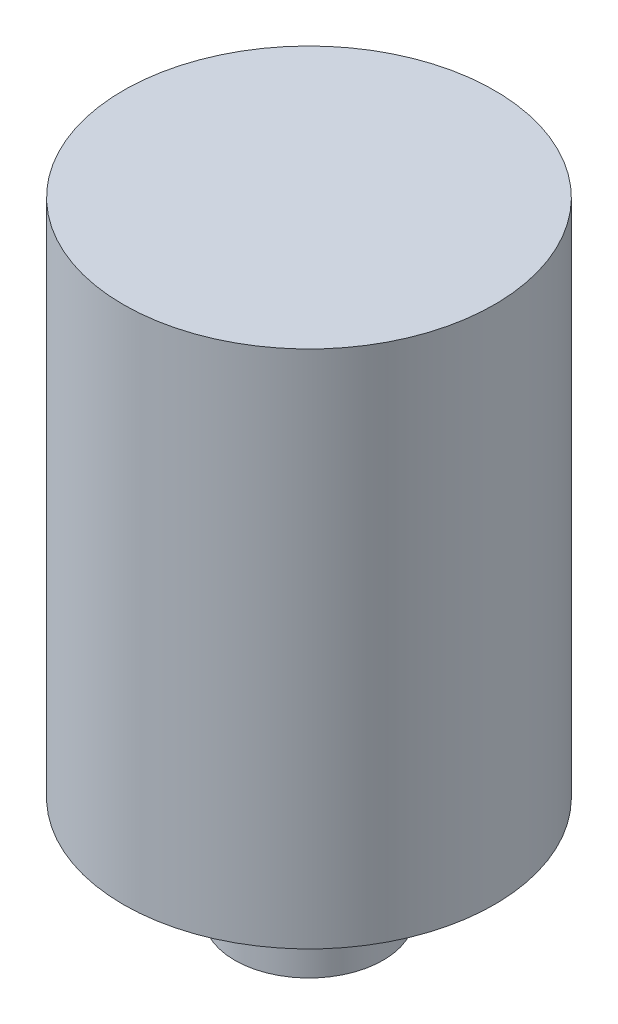
ISO-10303-21;
HEADER;
FILE_DESCRIPTION(('STEP AP214'),'2;1');
FILE_NAME('part.step','',(''),(''),'','','');
FILE_SCHEMA(('AUTOMOTIVE_DESIGN { 1 0 10303 214 1 1 1 1 }'));
ENDSEC;
DATA;
#1=APPLICATION_CONTEXT('core data for automotive mechanical design processes');
#2=APPLICATION_PROTOCOL_DEFINITION('international standard','automotive_design',2000,#1);
#3=PRODUCT_CONTEXT('',#1,'mechanical');
#4=PRODUCT('Part','Part','',(#3));
#5=PRODUCT_RELATED_PRODUCT_CATEGORY('part','',(#4));
#6=PRODUCT_DEFINITION_FORMATION('','',#4);
#7=PRODUCT_DEFINITION_CONTEXT('part definition',#1,'design');
#8=PRODUCT_DEFINITION('design','',#6,#7);
#9=PRODUCT_DEFINITION_SHAPE('','',#8);
#10=(LENGTH_UNIT() NAMED_UNIT(*) SI_UNIT(.MILLI.,.METRE.));
#11=(NAMED_UNIT(*) PLANE_ANGLE_UNIT() SI_UNIT($,.RADIAN.));
#12=(NAMED_UNIT(*) SI_UNIT($,.STERADIAN.) SOLID_ANGLE_UNIT());
#13=UNCERTAINTY_MEASURE_WITH_UNIT(LENGTH_MEASURE(1.E-05),#10,'distance_accuracy_value','');
#14=(GEOMETRIC_REPRESENTATION_CONTEXT(3) GLOBAL_UNCERTAINTY_ASSIGNED_CONTEXT((#13)) GLOBAL_UNIT_ASSIGNED_CONTEXT((#10,
#11,#12)) REPRESENTATION_CONTEXT('',''));
#15=CARTESIAN_POINT('',(0.,0.,0.));
#16=DIRECTION('',(0.,0.,1.));
#17=DIRECTION('',(1.,0.,0.));
#18=AXIS2_PLACEMENT_3D('',#15,#16,#17);
#19=CARTESIAN_POINT('',(0.,2.8,0.));
#20=DIRECTION('',(0.,-1.,0.));
#21=DIRECTION('',(0.,0.,-1.));
#22=AXIS2_PLACEMENT_3D('',#19,#20,#21);
#23=CYLINDRICAL_SURFACE('',#22,2.);
#24=CARTESIAN_POINT('',(0.,2.8,0.));
#25=DIRECTION('',(0.,1.,0.));
#26=DIRECTION('',(0.,0.,1.));
#27=AXIS2_PLACEMENT_3D('',#24,#25,#26);
#28=CIRCLE('',#27,2.);
#29=CARTESIAN_POINT('',(0.,2.8,2.));
#30=VERTEX_POINT('',#29);
#31=EDGE_CURVE('E10',#30,#30,#28,.T.);
#32=ORIENTED_EDGE('',*,*,#31,.F.);
#33=EDGE_LOOP('',(#32));
#34=FACE_BOUND('',#33,.T.);
#35=CARTESIAN_POINT('',(0.,0.,0.));
#36=DIRECTION('',(0.,1.,0.));
#37=DIRECTION('',(0.,0.,1.));
#38=AXIS2_PLACEMENT_3D('',#35,#36,#37);
#39=CIRCLE('',#38,2.);
#40=CARTESIAN_POINT('',(0.,0.,2.));
#41=VERTEX_POINT('',#40);
#42=EDGE_CURVE('E35',#41,#41,#39,.T.);
#43=ORIENTED_EDGE('',*,*,#42,.T.);
#44=EDGE_LOOP('',(#43));
#45=FACE_BOUND('',#44,.T.);
#46=ADVANCED_FACE('F32',(#34,#45),#23,.T.);
#47=CARTESIAN_POINT('',(0.,0.,0.));
#48=DIRECTION('',(0.,1.,0.));
#49=DIRECTION('',(0.,0.,1.));
#50=AXIS2_PLACEMENT_3D('',#47,#48,#49);
#51=PLANE('',#50);
#52=ORIENTED_EDGE('',*,*,#42,.F.);
#53=EDGE_LOOP('',(#52));
#54=FACE_BOUND('',#53,.T.);
#55=ADVANCED_FACE('F60',(#54),#51,.F.);
#56=CARTESIAN_POINT('',(0.,2.8,0.));
#57=DIRECTION('',(0.,1.,0.));
#58=DIRECTION('',(0.,0.,1.));
#59=AXIS2_PLACEMENT_3D('',#56,#57,#58);
#60=PLANE('',#59);
#61=CARTESIAN_POINT('',(0.,2.8,0.));
#62=DIRECTION('',(0.,1.,0.));
#63=DIRECTION('',(0.,0.,1.));
#64=AXIS2_PLACEMENT_3D('',#61,#62,#63);
#65=CIRCLE('',#64,5.);
#66=CARTESIAN_POINT('',(0.,2.8,5.));
#67=VERTEX_POINT('',#66);
#68=EDGE_CURVE('E44',#67,#67,#65,.T.);
#69=ORIENTED_EDGE('',*,*,#68,.F.);
#70=EDGE_LOOP('',(#69));
#71=FACE_BOUND('',#70,.T.);
#72=ORIENTED_EDGE('',*,*,#31,.T.);
#73=EDGE_LOOP('',(#72));
#74=FACE_BOUND('',#73,.T.);
#75=ADVANCED_FACE('F55',(#71,#74),#60,.F.);
#76=CARTESIAN_POINT('',(0.,16.8,0.));
#77=DIRECTION('',(0.,-1.,0.));
#78=DIRECTION('',(0.,0.,-1.));
#79=AXIS2_PLACEMENT_3D('',#76,#77,#78);
#80=CYLINDRICAL_SURFACE('',#79,5.);
#81=CARTESIAN_POINT('',(0.,16.8,0.));
#82=DIRECTION('',(0.,1.,0.));
#83=DIRECTION('',(0.,0.,1.));
#84=AXIS2_PLACEMENT_3D('',#81,#82,#83);
#85=CIRCLE('',#84,5.);
#86=CARTESIAN_POINT('',(0.,16.8,5.));
#87=VERTEX_POINT('',#86);
#88=EDGE_CURVE('E42',#87,#87,#85,.T.);
#89=ORIENTED_EDGE('',*,*,#88,.F.);
#90=EDGE_LOOP('',(#89));
#91=FACE_BOUND('',#90,.T.);
#92=ORIENTED_EDGE('',*,*,#68,.T.);
#93=EDGE_LOOP('',(#92));
#94=FACE_BOUND('',#93,.T.);
#95=ADVANCED_FACE('F52',(#91,#94),#80,.T.);
#96=CARTESIAN_POINT('',(0.,16.8,0.));
#97=DIRECTION('',(0.,1.,0.));
#98=DIRECTION('',(0.,0.,1.));
#99=AXIS2_PLACEMENT_3D('',#96,#97,#98);
#100=PLANE('',#99);
#101=ORIENTED_EDGE('',*,*,#88,.T.);
#102=EDGE_LOOP('',(#101));
#103=FACE_BOUND('',#102,.T.);
#104=ADVANCED_FACE('F50',(#103),#100,.T.);
#105=CLOSED_SHELL('',(#46,#55,#75,#95,#104));
#106=MANIFOLD_SOLID_BREP('B2',#105);
#107=ADVANCED_BREP_SHAPE_REPRESENTATION('',(#18,#106),#14);
#108=SHAPE_DEFINITION_REPRESENTATION(#9,#107);
ENDSEC;
END-ISO-10303-21;
